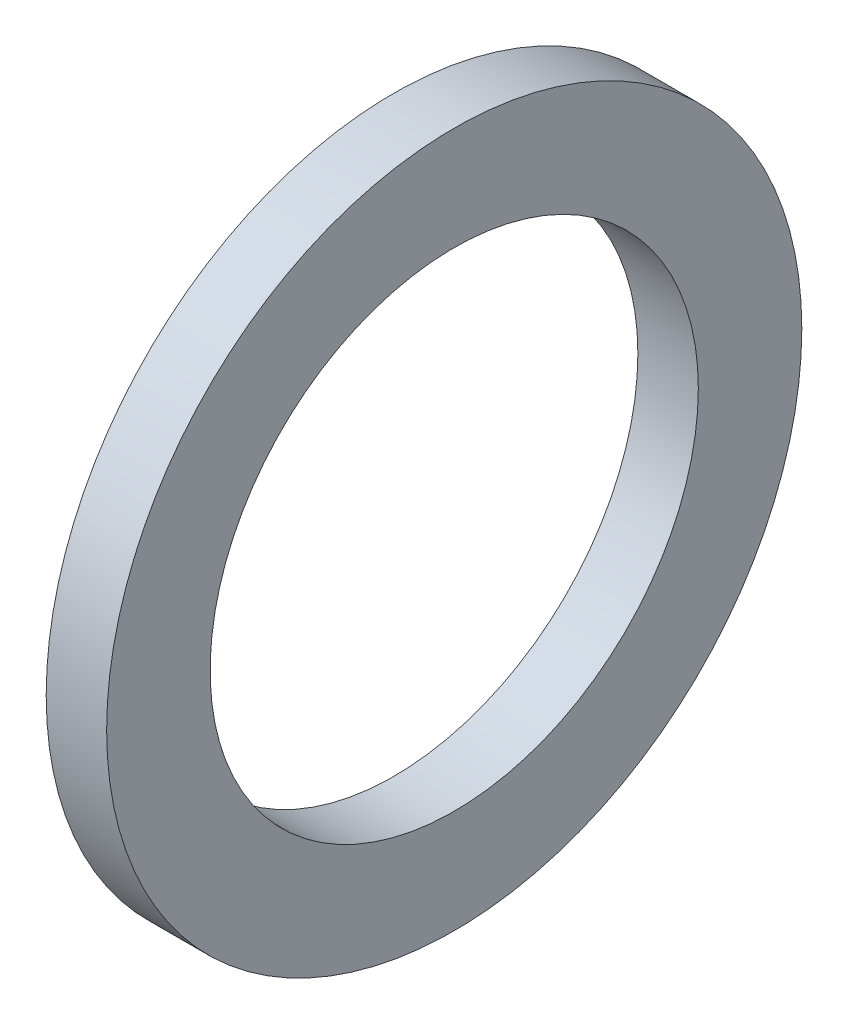
ISO-10303-21;
HEADER;
FILE_DESCRIPTION(('STEP AP214'),'2;1');
FILE_NAME('part.step','',(''),(''),'','','');
FILE_SCHEMA(('AUTOMOTIVE_DESIGN { 1 0 10303 214 1 1 1 1 }'));
ENDSEC;
DATA;
#1=APPLICATION_CONTEXT('core data for automotive mechanical design processes');
#2=APPLICATION_PROTOCOL_DEFINITION('international standard','automotive_design',2000,#1);
#3=PRODUCT_CONTEXT('',#1,'mechanical');
#4=PRODUCT('Part','Part','',(#3));
#5=PRODUCT_RELATED_PRODUCT_CATEGORY('part','',(#4));
#6=PRODUCT_DEFINITION_FORMATION('','',#4);
#7=PRODUCT_DEFINITION_CONTEXT('part definition',#1,'design');
#8=PRODUCT_DEFINITION('design','',#6,#7);
#9=PRODUCT_DEFINITION_SHAPE('','',#8);
#10=(LENGTH_UNIT() NAMED_UNIT(*) SI_UNIT(.MILLI.,.METRE.));
#11=(NAMED_UNIT(*) PLANE_ANGLE_UNIT() SI_UNIT($,.RADIAN.));
#12=(NAMED_UNIT(*) SI_UNIT($,.STERADIAN.) SOLID_ANGLE_UNIT());
#13=UNCERTAINTY_MEASURE_WITH_UNIT(LENGTH_MEASURE(1.E-05),#10,'distance_accuracy_value','');
#14=(GEOMETRIC_REPRESENTATION_CONTEXT(3) GLOBAL_UNCERTAINTY_ASSIGNED_CONTEXT((#13)) GLOBAL_UNIT_ASSIGNED_CONTEXT((#10,
#11,#12)) REPRESENTATION_CONTEXT('',''));
#15=CARTESIAN_POINT('',(0.,0.,0.));
#16=DIRECTION('',(0.,0.,1.));
#17=DIRECTION('',(1.,0.,0.));
#18=AXIS2_PLACEMENT_3D('',#15,#16,#17);
#19=CARTESIAN_POINT('',(2.,0.,0.));
#20=DIRECTION('',(1.,0.,0.));
#21=DIRECTION('',(0.,0.,-1.));
#22=AXIS2_PLACEMENT_3D('',#19,#20,#21);
#23=PLANE('',#22);
#24=CARTESIAN_POINT('',(2.,0.,0.));
#25=DIRECTION('',(1.,0.,0.));
#26=DIRECTION('',(0.,0.,-1.));
#27=AXIS2_PLACEMENT_3D('',#24,#25,#26);
#28=CIRCLE('',#27,11.5);
#29=CARTESIAN_POINT('',(2.,0.,-11.5));
#30=VERTEX_POINT('',#29);
#31=EDGE_CURVE('E10',#30,#30,#28,.T.);
#32=ORIENTED_EDGE('',*,*,#31,.T.);
#33=EDGE_LOOP('',(#32));
#34=FACE_BOUND('',#33,.T.);
#35=CARTESIAN_POINT('',(2.,0.,0.));
#36=DIRECTION('',(1.,0.,0.));
#37=DIRECTION('',(0.,0.,-1.));
#38=AXIS2_PLACEMENT_3D('',#35,#36,#37);
#39=CIRCLE('',#38,8.076127585);
#40=CARTESIAN_POINT('',(2.,0.,-8.076127585));
#41=VERTEX_POINT('',#40);
#42=EDGE_CURVE('E46',#41,#41,#39,.T.);
#43=ORIENTED_EDGE('',*,*,#42,.F.);
#44=EDGE_LOOP('',(#43));
#45=FACE_BOUND('',#44,.T.);
#46=ADVANCED_FACE('F35',(#34,#45),#23,.T.);
#47=CARTESIAN_POINT('',(0.,0.,0.));
#48=DIRECTION('',(1.,0.,0.));
#49=DIRECTION('',(0.,0.,-1.));
#50=AXIS2_PLACEMENT_3D('',#47,#48,#49);
#51=PLANE('',#50);
#52=CARTESIAN_POINT('',(0.,0.,0.));
#53=DIRECTION('',(1.,0.,0.));
#54=DIRECTION('',(0.,0.,-1.));
#55=AXIS2_PLACEMENT_3D('',#52,#53,#54);
#56=CIRCLE('',#55,11.5);
#57=CARTESIAN_POINT('',(0.,0.,-11.5));
#58=VERTEX_POINT('',#57);
#59=EDGE_CURVE('E39',#58,#58,#56,.T.);
#60=ORIENTED_EDGE('',*,*,#59,.F.);
#61=EDGE_LOOP('',(#60));
#62=FACE_BOUND('',#61,.T.);
#63=CARTESIAN_POINT('',(0.,0.,0.));
#64=DIRECTION('',(1.,0.,0.));
#65=DIRECTION('',(0.,0.,-1.));
#66=AXIS2_PLACEMENT_3D('',#63,#64,#65);
#67=CIRCLE('',#66,8.076127585);
#68=CARTESIAN_POINT('',(0.,0.,-8.076127585));
#69=VERTEX_POINT('',#68);
#70=EDGE_CURVE('E48',#69,#69,#67,.T.);
#71=ORIENTED_EDGE('',*,*,#70,.T.);
#72=EDGE_LOOP('',(#71));
#73=FACE_BOUND('',#72,.T.);
#74=ADVANCED_FACE('F58',(#62,#73),#51,.F.);
#75=CARTESIAN_POINT('',(2.,0.,0.));
#76=DIRECTION('',(-1.,0.,0.));
#77=DIRECTION('',(0.,0.,1.));
#78=AXIS2_PLACEMENT_3D('',#75,#76,#77);
#79=CYLINDRICAL_SURFACE('',#78,11.5);
#80=ORIENTED_EDGE('',*,*,#31,.F.);
#81=EDGE_LOOP('',(#80));
#82=FACE_BOUND('',#81,.T.);
#83=ORIENTED_EDGE('',*,*,#59,.T.);
#84=EDGE_LOOP('',(#83));
#85=FACE_BOUND('',#84,.T.);
#86=ADVANCED_FACE('F37',(#82,#85),#79,.T.);
#87=CARTESIAN_POINT('',(2.,0.,0.));
#88=DIRECTION('',(-1.,0.,0.));
#89=DIRECTION('',(0.,0.,1.));
#90=AXIS2_PLACEMENT_3D('',#87,#88,#89);
#91=CYLINDRICAL_SURFACE('',#90,8.076127585);
#92=ORIENTED_EDGE('',*,*,#42,.T.);
#93=EDGE_LOOP('',(#92));
#94=FACE_BOUND('',#93,.T.);
#95=ORIENTED_EDGE('',*,*,#70,.F.);
#96=EDGE_LOOP('',(#95));
#97=FACE_BOUND('',#96,.T.);
#98=ADVANCED_FACE('F54',(#94,#97),#91,.F.);
#99=CLOSED_SHELL('',(#46,#74,#86,#98));
#100=MANIFOLD_SOLID_BREP('B2',#99);
#101=ADVANCED_BREP_SHAPE_REPRESENTATION('',(#18,#100),#14);
#102=SHAPE_DEFINITION_REPRESENTATION(#9,#101);
ENDSEC;
END-ISO-10303-21;
